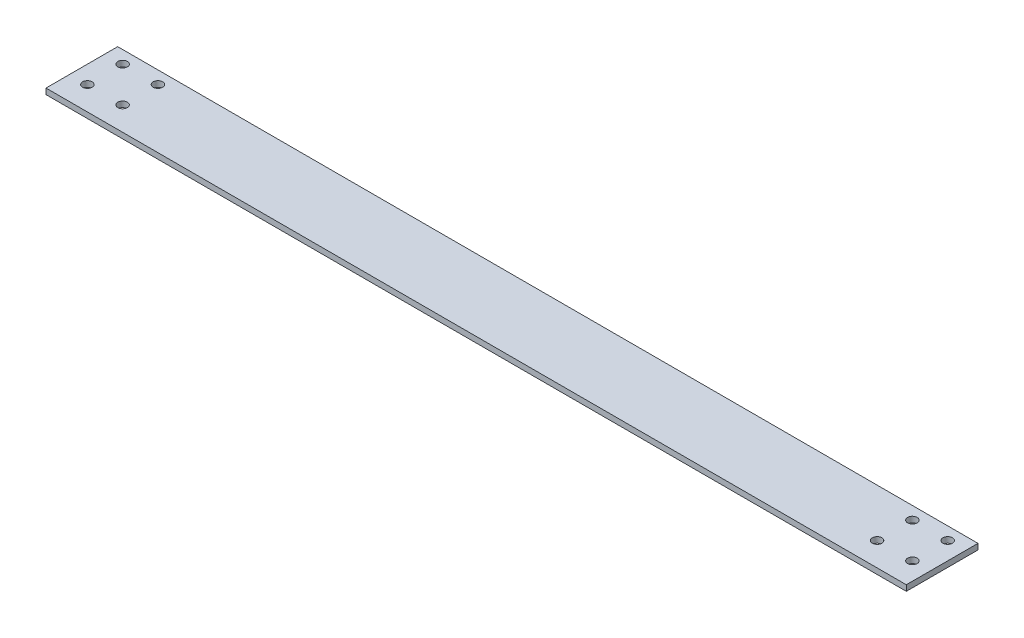
ISO-10303-21;
HEADER;
FILE_DESCRIPTION(('STEP AP214'),'2;1');
FILE_NAME('part.step','',(''),(''),'','','');
FILE_SCHEMA(('AUTOMOTIVE_DESIGN { 1 0 10303 214 1 1 1 1 }'));
ENDSEC;
DATA;
#1=APPLICATION_CONTEXT('core data for automotive mechanical design processes');
#2=APPLICATION_PROTOCOL_DEFINITION('international standard','automotive_design',2000,#1);
#3=PRODUCT_CONTEXT('',#1,'mechanical');
#4=PRODUCT('Part','Part','',(#3));
#5=PRODUCT_RELATED_PRODUCT_CATEGORY('part','',(#4));
#6=PRODUCT_DEFINITION_FORMATION('','',#4);
#7=PRODUCT_DEFINITION_CONTEXT('part definition',#1,'design');
#8=PRODUCT_DEFINITION('design','',#6,#7);
#9=PRODUCT_DEFINITION_SHAPE('','',#8);
#10=(LENGTH_UNIT() NAMED_UNIT(*) SI_UNIT(.MILLI.,.METRE.));
#11=(NAMED_UNIT(*) PLANE_ANGLE_UNIT() SI_UNIT($,.RADIAN.));
#12=(NAMED_UNIT(*) SI_UNIT($,.STERADIAN.) SOLID_ANGLE_UNIT());
#13=UNCERTAINTY_MEASURE_WITH_UNIT(LENGTH_MEASURE(1.E-05),#10,'distance_accuracy_value','');
#14=(GEOMETRIC_REPRESENTATION_CONTEXT(3) GLOBAL_UNCERTAINTY_ASSIGNED_CONTEXT((#13)) GLOBAL_UNIT_ASSIGNED_CONTEXT((#10,
#11,#12)) REPRESENTATION_CONTEXT('',''));
#15=CARTESIAN_POINT('',(0.,0.,0.));
#16=DIRECTION('',(0.,0.,1.));
#17=DIRECTION('',(1.,0.,0.));
#18=AXIS2_PLACEMENT_3D('',#15,#16,#17);
#19=CARTESIAN_POINT('',(0.,4.064,0.));
#20=DIRECTION('',(0.,1.,0.));
#21=DIRECTION('',(0.,0.,1.));
#22=AXIS2_PLACEMENT_3D('',#19,#20,#21);
#23=PLANE('',#22);
#24=CARTESIAN_POINT('',(12.5000000000001,4.064,-41.8000000000001));
#25=DIRECTION('',(0.,-1.,0.));
#26=DIRECTION('',(0.,0.,-1.));
#27=AXIS2_PLACEMENT_3D('',#24,#25,#26);
#28=CIRCLE('',#27,3.3782);
#29=CARTESIAN_POINT('',(12.5000000000001,4.064,-45.1782000000001));
#30=VERTEX_POINT('',#29);
#31=EDGE_CURVE('E151',#30,#30,#28,.T.);
#32=ORIENTED_EDGE('',*,*,#31,.T.);
#33=EDGE_LOOP('',(#32));
#34=FACE_BOUND('',#33,.T.);
#35=CARTESIAN_POINT('',(37.5000000000001,4.064,-41.8000000000001));
#36=DIRECTION('',(0.,-1.,0.));
#37=DIRECTION('',(0.,0.,-1.));
#38=AXIS2_PLACEMENT_3D('',#35,#36,#37);
#39=CIRCLE('',#38,3.3782);
#40=CARTESIAN_POINT('',(37.5000000000001,4.064,-45.1782000000001));
#41=VERTEX_POINT('',#40);
#42=EDGE_CURVE('E145',#41,#41,#39,.T.);
#43=ORIENTED_EDGE('',*,*,#42,.T.);
#44=EDGE_LOOP('',(#43));
#45=FACE_BOUND('',#44,.T.);
#46=CARTESIAN_POINT('',(37.5000000000001,4.064,-16.8000000000001));
#47=DIRECTION('',(0.,-1.,0.));
#48=DIRECTION('',(0.,0.,-1.));
#49=AXIS2_PLACEMENT_3D('',#46,#47,#48);
#50=CIRCLE('',#49,3.3782);
#51=CARTESIAN_POINT('',(37.5000000000001,4.064,-20.1782000000001));
#52=VERTEX_POINT('',#51);
#53=EDGE_CURVE('E139',#52,#52,#50,.T.);
#54=ORIENTED_EDGE('',*,*,#53,.T.);
#55=EDGE_LOOP('',(#54));
#56=FACE_BOUND('',#55,.T.);
#57=CARTESIAN_POINT('',(12.5000000000001,4.064,-16.8000000000001));
#58=DIRECTION('',(0.,-1.,0.));
#59=DIRECTION('',(0.,0.,-1.));
#60=AXIS2_PLACEMENT_3D('',#57,#58,#59);
#61=CIRCLE('',#60,3.3782);
#62=CARTESIAN_POINT('',(12.5000000000001,4.064,-20.1782000000001));
#63=VERTEX_POINT('',#62);
#64=EDGE_CURVE('E133',#63,#63,#61,.T.);
#65=ORIENTED_EDGE('',*,*,#64,.T.);
#66=EDGE_LOOP('',(#65));
#67=FACE_BOUND('',#66,.T.);
#68=CARTESIAN_POINT('',(572.1,4.064,-41.7999999999995));
#69=DIRECTION('',(0.,-1.,0.));
#70=DIRECTION('',(0.,0.,-1.));
#71=AXIS2_PLACEMENT_3D('',#68,#69,#70);
#72=CIRCLE('',#71,3.3782);
#73=CARTESIAN_POINT('',(572.1,4.064,-45.1781999999995));
#74=VERTEX_POINT('',#73);
#75=EDGE_CURVE('E127',#74,#74,#72,.T.);
#76=ORIENTED_EDGE('',*,*,#75,.T.);
#77=EDGE_LOOP('',(#76));
#78=FACE_BOUND('',#77,.T.);
#79=CARTESIAN_POINT('',(597.1,4.064,-41.7999999999995));
#80=DIRECTION('',(0.,-1.,0.));
#81=DIRECTION('',(0.,0.,-1.));
#82=AXIS2_PLACEMENT_3D('',#79,#80,#81);
#83=CIRCLE('',#82,3.3782);
#84=CARTESIAN_POINT('',(597.1,4.064,-45.1781999999995));
#85=VERTEX_POINT('',#84);
#86=EDGE_CURVE('E121',#85,#85,#83,.T.);
#87=ORIENTED_EDGE('',*,*,#86,.T.);
#88=EDGE_LOOP('',(#87));
#89=FACE_BOUND('',#88,.T.);
#90=CARTESIAN_POINT('',(597.1,4.064,-16.7999999999995));
#91=DIRECTION('',(0.,-1.,0.));
#92=DIRECTION('',(0.,0.,-1.));
#93=AXIS2_PLACEMENT_3D('',#90,#91,#92);
#94=CIRCLE('',#93,3.3782);
#95=CARTESIAN_POINT('',(597.1,4.064,-20.1781999999995));
#96=VERTEX_POINT('',#95);
#97=EDGE_CURVE('E115',#96,#96,#94,.T.);
#98=ORIENTED_EDGE('',*,*,#97,.T.);
#99=EDGE_LOOP('',(#98));
#100=FACE_BOUND('',#99,.T.);
#101=DIRECTION('',(0.,0.,1.));
#102=VECTOR('',#101,1.);
#103=CARTESIAN_POINT('',(609.6,4.064,0.));
#104=LINE('',#103,#102);
#105=CARTESIAN_POINT('',(609.6,4.064,-50.8000000000001));
#106=VERTEX_POINT('',#105);
#107=CARTESIAN_POINT('',(609.6,4.064,-1.11998084417753E-13));
#108=VERTEX_POINT('',#107);
#109=EDGE_CURVE('E92',#106,#108,#104,.T.);
#110=ORIENTED_EDGE('',*,*,#109,.F.);
#111=DIRECTION('',(1.,0.,0.));
#112=VECTOR('',#111,1.);
#113=CARTESIAN_POINT('',(0.,4.064,-50.8000000000001));
#114=LINE('',#113,#112);
#115=CARTESIAN_POINT('',(0.,4.064,-50.8000000000001));
#116=VERTEX_POINT('',#115);
#117=EDGE_CURVE('E83',#116,#106,#114,.T.);
#118=ORIENTED_EDGE('',*,*,#117,.F.);
#119=DIRECTION('',(0.,0.,-1.));
#120=VECTOR('',#119,1.);
#121=CARTESIAN_POINT('',(0.,4.064,0.));
#122=LINE('',#121,#120);
#123=CARTESIAN_POINT('',(0.,4.064,0.));
#124=VERTEX_POINT('',#123);
#125=EDGE_CURVE('E91',#124,#116,#122,.T.);
#126=ORIENTED_EDGE('',*,*,#125,.F.);
#127=DIRECTION('',(1.,0.,0.));
#128=VECTOR('',#127,1.);
#129=CARTESIAN_POINT('',(0.,4.064,0.));
#130=LINE('',#129,#128);
#131=EDGE_CURVE('E52',#124,#108,#130,.T.);
#132=ORIENTED_EDGE('',*,*,#131,.T.);
#133=EDGE_LOOP('',(#110,#118,#126,#132));
#134=FACE_BOUND('',#133,.T.);
#135=CARTESIAN_POINT('',(572.1,4.064,-16.7999999999995));
#136=DIRECTION('',(0.,-1.,0.));
#137=DIRECTION('',(0.,0.,-1.));
#138=AXIS2_PLACEMENT_3D('',#135,#136,#137);
#139=CIRCLE('',#138,3.3782);
#140=CARTESIAN_POINT('',(572.1,4.064,-20.1781999999995));
#141=VERTEX_POINT('',#140);
#142=EDGE_CURVE('E102',#141,#141,#139,.T.);
#143=ORIENTED_EDGE('',*,*,#142,.T.);
#144=EDGE_LOOP('',(#143));
#145=FACE_BOUND('',#144,.T.);
#146=ADVANCED_FACE('F35',(#34,#45,#56,#67,#78,#89,#100,#134,#145),#23,.T.);
#147=CARTESIAN_POINT('',(609.6,4.064,0.));
#148=DIRECTION('',(1.,0.,0.));
#149=DIRECTION('',(0.,0.,-1.));
#150=AXIS2_PLACEMENT_3D('',#147,#148,#149);
#151=PLANE('',#150);
#152=DIRECTION('',(0.,0.,1.));
#153=VECTOR('',#152,1.);
#154=CARTESIAN_POINT('',(609.6,0.,0.));
#155=LINE('',#154,#153);
#156=CARTESIAN_POINT('',(609.6,0.,-50.8000000000001));
#157=VERTEX_POINT('',#156);
#158=CARTESIAN_POINT('',(609.6,0.,-1.11998084417753E-13));
#159=VERTEX_POINT('',#158);
#160=EDGE_CURVE('E99',#157,#159,#155,.T.);
#161=ORIENTED_EDGE('',*,*,#160,.F.);
#162=DIRECTION('',(0.,-1.,0.));
#163=VECTOR('',#162,1.);
#164=CARTESIAN_POINT('',(609.6,4.064,-50.8000000000001));
#165=LINE('',#164,#163);
#166=EDGE_CURVE('E11',#106,#157,#165,.T.);
#167=ORIENTED_EDGE('',*,*,#166,.F.);
#168=ORIENTED_EDGE('',*,*,#109,.T.);
#169=DIRECTION('',(0.,-1.,0.));
#170=VECTOR('',#169,1.);
#171=CARTESIAN_POINT('',(609.6,4.064,-1.11998084417753E-13));
#172=LINE('',#171,#170);
#173=EDGE_CURVE('E74',#108,#159,#172,.T.);
#174=ORIENTED_EDGE('',*,*,#173,.T.);
#175=EDGE_LOOP('',(#161,#167,#168,#174));
#176=FACE_BOUND('',#175,.T.);
#177=ADVANCED_FACE('F37',(#176),#151,.T.);
#178=CARTESIAN_POINT('',(0.,4.064,-50.8000000000001));
#179=DIRECTION('',(0.,0.,-1.));
#180=DIRECTION('',(-1.,0.,0.));
#181=AXIS2_PLACEMENT_3D('',#178,#179,#180);
#182=PLANE('',#181);
#183=DIRECTION('',(1.,0.,0.));
#184=VECTOR('',#183,1.);
#185=CARTESIAN_POINT('',(0.,0.,-50.8000000000001));
#186=LINE('',#185,#184);
#187=CARTESIAN_POINT('',(0.,0.,-50.8000000000001));
#188=VERTEX_POINT('',#187);
#189=EDGE_CURVE('E85',#188,#157,#186,.T.);
#190=ORIENTED_EDGE('',*,*,#189,.F.);
#191=DIRECTION('',(0.,-1.,0.));
#192=VECTOR('',#191,1.);
#193=CARTESIAN_POINT('',(0.,4.064,-50.8000000000001));
#194=LINE('',#193,#192);
#195=EDGE_CURVE('E44',#116,#188,#194,.T.);
#196=ORIENTED_EDGE('',*,*,#195,.F.);
#197=ORIENTED_EDGE('',*,*,#117,.T.);
#198=ORIENTED_EDGE('',*,*,#166,.T.);
#199=EDGE_LOOP('',(#190,#196,#197,#198));
#200=FACE_BOUND('',#199,.T.);
#201=ADVANCED_FACE('F82',(#200),#182,.T.);
#202=CARTESIAN_POINT('',(0.,4.064,0.));
#203=DIRECTION('',(-1.,0.,0.));
#204=DIRECTION('',(0.,0.,1.));
#205=AXIS2_PLACEMENT_3D('',#202,#203,#204);
#206=PLANE('',#205);
#207=DIRECTION('',(0.,0.,-1.));
#208=VECTOR('',#207,1.);
#209=CARTESIAN_POINT('',(0.,0.,0.));
#210=LINE('',#209,#208);
#211=CARTESIAN_POINT('',(0.,0.,0.));
#212=VERTEX_POINT('',#211);
#213=EDGE_CURVE('E104',#212,#188,#210,.T.);
#214=ORIENTED_EDGE('',*,*,#213,.F.);
#215=DIRECTION('',(0.,-1.,0.));
#216=VECTOR('',#215,1.);
#217=CARTESIAN_POINT('',(0.,4.064,0.));
#218=LINE('',#217,#216);
#219=EDGE_CURVE('E67',#124,#212,#218,.T.);
#220=ORIENTED_EDGE('',*,*,#219,.F.);
#221=ORIENTED_EDGE('',*,*,#125,.T.);
#222=ORIENTED_EDGE('',*,*,#195,.T.);
#223=EDGE_LOOP('',(#214,#220,#221,#222));
#224=FACE_BOUND('',#223,.T.);
#225=ADVANCED_FACE('F94',(#224),#206,.T.);
#226=CARTESIAN_POINT('',(0.,4.064,0.));
#227=DIRECTION('',(0.,0.,-1.));
#228=DIRECTION('',(-1.,0.,0.));
#229=AXIS2_PLACEMENT_3D('',#226,#227,#228);
#230=PLANE('',#229);
#231=DIRECTION('',(1.,0.,0.));
#232=VECTOR('',#231,1.);
#233=CARTESIAN_POINT('',(0.,0.,0.));
#234=LINE('',#233,#232);
#235=EDGE_CURVE('E106',#212,#159,#234,.T.);
#236=ORIENTED_EDGE('',*,*,#235,.T.);
#237=ORIENTED_EDGE('',*,*,#173,.F.);
#238=ORIENTED_EDGE('',*,*,#131,.F.);
#239=ORIENTED_EDGE('',*,*,#219,.T.);
#240=EDGE_LOOP('',(#236,#237,#238,#239));
#241=FACE_BOUND('',#240,.T.);
#242=ADVANCED_FACE('F164',(#241),#230,.F.);
#243=CARTESIAN_POINT('',(0.,0.,0.));
#244=DIRECTION('',(0.,1.,0.));
#245=DIRECTION('',(0.,0.,1.));
#246=AXIS2_PLACEMENT_3D('',#243,#244,#245);
#247=PLANE('',#246);
#248=CARTESIAN_POINT('',(12.5000000000001,0.,-41.8000000000001));
#249=DIRECTION('',(0.,-1.,0.));
#250=DIRECTION('',(0.,0.,-1.));
#251=AXIS2_PLACEMENT_3D('',#248,#249,#250);
#252=CIRCLE('',#251,3.37819999999999);
#253=CARTESIAN_POINT('',(12.5000000000001,0.,-45.1782000000001));
#254=VERTEX_POINT('',#253);
#255=EDGE_CURVE('E154',#254,#254,#252,.T.);
#256=ORIENTED_EDGE('',*,*,#255,.F.);
#257=EDGE_LOOP('',(#256));
#258=FACE_BOUND('',#257,.T.);
#259=CARTESIAN_POINT('',(37.5000000000001,0.,-41.8000000000001));
#260=DIRECTION('',(0.,-1.,0.));
#261=DIRECTION('',(0.,0.,-1.));
#262=AXIS2_PLACEMENT_3D('',#259,#260,#261);
#263=CIRCLE('',#262,3.37819999999998);
#264=CARTESIAN_POINT('',(37.5000000000001,0.,-45.1782000000001));
#265=VERTEX_POINT('',#264);
#266=EDGE_CURVE('E148',#265,#265,#263,.T.);
#267=ORIENTED_EDGE('',*,*,#266,.F.);
#268=EDGE_LOOP('',(#267));
#269=FACE_BOUND('',#268,.T.);
#270=CARTESIAN_POINT('',(37.5000000000001,0.,-16.8000000000001));
#271=DIRECTION('',(0.,-1.,0.));
#272=DIRECTION('',(0.,0.,-1.));
#273=AXIS2_PLACEMENT_3D('',#270,#271,#272);
#274=CIRCLE('',#273,3.37819999999998);
#275=CARTESIAN_POINT('',(37.5000000000001,0.,-20.1782000000001));
#276=VERTEX_POINT('',#275);
#277=EDGE_CURVE('E142',#276,#276,#274,.T.);
#278=ORIENTED_EDGE('',*,*,#277,.F.);
#279=EDGE_LOOP('',(#278));
#280=FACE_BOUND('',#279,.T.);
#281=CARTESIAN_POINT('',(12.5000000000001,0.,-16.8000000000001));
#282=DIRECTION('',(0.,-1.,0.));
#283=DIRECTION('',(0.,0.,-1.));
#284=AXIS2_PLACEMENT_3D('',#281,#282,#283);
#285=CIRCLE('',#284,3.37819999999999);
#286=CARTESIAN_POINT('',(12.5000000000001,0.,-20.1782000000001));
#287=VERTEX_POINT('',#286);
#288=EDGE_CURVE('E136',#287,#287,#285,.T.);
#289=ORIENTED_EDGE('',*,*,#288,.F.);
#290=EDGE_LOOP('',(#289));
#291=FACE_BOUND('',#290,.T.);
#292=CARTESIAN_POINT('',(572.1,0.,-41.7999999999995));
#293=DIRECTION('',(0.,-1.,0.));
#294=DIRECTION('',(0.,0.,-1.));
#295=AXIS2_PLACEMENT_3D('',#292,#293,#294);
#296=CIRCLE('',#295,3.3782);
#297=CARTESIAN_POINT('',(572.1,0.,-45.1781999999995));
#298=VERTEX_POINT('',#297);
#299=EDGE_CURVE('E130',#298,#298,#296,.T.);
#300=ORIENTED_EDGE('',*,*,#299,.F.);
#301=EDGE_LOOP('',(#300));
#302=FACE_BOUND('',#301,.T.);
#303=CARTESIAN_POINT('',(597.1,0.,-41.7999999999995));
#304=DIRECTION('',(0.,-1.,0.));
#305=DIRECTION('',(0.,0.,-1.));
#306=AXIS2_PLACEMENT_3D('',#303,#304,#305);
#307=CIRCLE('',#306,3.3782);
#308=CARTESIAN_POINT('',(597.1,0.,-45.1781999999995));
#309=VERTEX_POINT('',#308);
#310=EDGE_CURVE('E124',#309,#309,#307,.T.);
#311=ORIENTED_EDGE('',*,*,#310,.F.);
#312=EDGE_LOOP('',(#311));
#313=FACE_BOUND('',#312,.T.);
#314=CARTESIAN_POINT('',(597.1,0.,-16.7999999999995));
#315=DIRECTION('',(0.,-1.,0.));
#316=DIRECTION('',(0.,0.,-1.));
#317=AXIS2_PLACEMENT_3D('',#314,#315,#316);
#318=CIRCLE('',#317,3.3782);
#319=CARTESIAN_POINT('',(597.1,0.,-20.1781999999995));
#320=VERTEX_POINT('',#319);
#321=EDGE_CURVE('E118',#320,#320,#318,.T.);
#322=ORIENTED_EDGE('',*,*,#321,.F.);
#323=EDGE_LOOP('',(#322));
#324=FACE_BOUND('',#323,.T.);
#325=CARTESIAN_POINT('',(572.1,0.,-16.7999999999995));
#326=DIRECTION('',(0.,-1.,0.));
#327=DIRECTION('',(0.,0.,-1.));
#328=AXIS2_PLACEMENT_3D('',#325,#326,#327);
#329=CIRCLE('',#328,3.3782);
#330=CARTESIAN_POINT('',(572.1,0.,-20.1781999999995));
#331=VERTEX_POINT('',#330);
#332=EDGE_CURVE('E112',#331,#331,#329,.T.);
#333=ORIENTED_EDGE('',*,*,#332,.F.);
#334=EDGE_LOOP('',(#333));
#335=FACE_BOUND('',#334,.T.);
#336=ORIENTED_EDGE('',*,*,#160,.T.);
#337=ORIENTED_EDGE('',*,*,#235,.F.);
#338=ORIENTED_EDGE('',*,*,#213,.T.);
#339=ORIENTED_EDGE('',*,*,#189,.T.);
#340=EDGE_LOOP('',(#336,#337,#338,#339));
#341=FACE_BOUND('',#340,.T.);
#342=ADVANCED_FACE('F160',(#258,#269,#280,#291,#302,#313,#324,#335,#341),#247,.F.);
#343=CARTESIAN_POINT('',(572.1,0.,-16.7999999999995));
#344=DIRECTION('',(0.,-1.,0.));
#345=DIRECTION('',(0.,0.,-1.));
#346=AXIS2_PLACEMENT_3D('',#343,#344,#345);
#347=CYLINDRICAL_SURFACE('',#346,3.3782);
#348=ORIENTED_EDGE('',*,*,#142,.F.);
#349=EDGE_LOOP('',(#348));
#350=FACE_BOUND('',#349,.T.);
#351=ORIENTED_EDGE('',*,*,#332,.T.);
#352=EDGE_LOOP('',(#351));
#353=FACE_BOUND('',#352,.T.);
#354=ADVANCED_FACE('F163',(#350,#353),#347,.F.);
#355=CARTESIAN_POINT('',(597.1,0.,-16.7999999999995));
#356=DIRECTION('',(0.,-1.,0.));
#357=DIRECTION('',(0.,0.,-1.));
#358=AXIS2_PLACEMENT_3D('',#355,#356,#357);
#359=CYLINDRICAL_SURFACE('',#358,3.3782);
#360=ORIENTED_EDGE('',*,*,#97,.F.);
#361=EDGE_LOOP('',(#360));
#362=FACE_BOUND('',#361,.T.);
#363=ORIENTED_EDGE('',*,*,#321,.T.);
#364=EDGE_LOOP('',(#363));
#365=FACE_BOUND('',#364,.T.);
#366=ADVANCED_FACE('F214',(#362,#365),#359,.F.);
#367=CARTESIAN_POINT('',(597.1,0.,-41.7999999999995));
#368=DIRECTION('',(0.,-1.,0.));
#369=DIRECTION('',(0.,0.,-1.));
#370=AXIS2_PLACEMENT_3D('',#367,#368,#369);
#371=CYLINDRICAL_SURFACE('',#370,3.3782);
#372=ORIENTED_EDGE('',*,*,#86,.F.);
#373=EDGE_LOOP('',(#372));
#374=FACE_BOUND('',#373,.T.);
#375=ORIENTED_EDGE('',*,*,#310,.T.);
#376=EDGE_LOOP('',(#375));
#377=FACE_BOUND('',#376,.T.);
#378=ADVANCED_FACE('F221',(#374,#377),#371,.F.);
#379=CARTESIAN_POINT('',(572.1,0.,-41.7999999999995));
#380=DIRECTION('',(0.,-1.,0.));
#381=DIRECTION('',(0.,0.,-1.));
#382=AXIS2_PLACEMENT_3D('',#379,#380,#381);
#383=CYLINDRICAL_SURFACE('',#382,3.3782);
#384=ORIENTED_EDGE('',*,*,#75,.F.);
#385=EDGE_LOOP('',(#384));
#386=FACE_BOUND('',#385,.T.);
#387=ORIENTED_EDGE('',*,*,#299,.T.);
#388=EDGE_LOOP('',(#387));
#389=FACE_BOUND('',#388,.T.);
#390=ADVANCED_FACE('F228',(#386,#389),#383,.F.);
#391=CARTESIAN_POINT('',(12.5000000000001,0.,-16.8000000000001));
#392=DIRECTION('',(0.,-1.,0.));
#393=DIRECTION('',(0.,0.,-1.));
#394=AXIS2_PLACEMENT_3D('',#391,#392,#393);
#395=CYLINDRICAL_SURFACE('',#394,3.37819999999999);
#396=ORIENTED_EDGE('',*,*,#64,.F.);
#397=EDGE_LOOP('',(#396));
#398=FACE_BOUND('',#397,.T.);
#399=ORIENTED_EDGE('',*,*,#288,.T.);
#400=EDGE_LOOP('',(#399));
#401=FACE_BOUND('',#400,.T.);
#402=ADVANCED_FACE('F236',(#398,#401),#395,.F.);
#403=CARTESIAN_POINT('',(37.5000000000001,0.,-16.8000000000001));
#404=DIRECTION('',(0.,-1.,0.));
#405=DIRECTION('',(0.,0.,-1.));
#406=AXIS2_PLACEMENT_3D('',#403,#404,#405);
#407=CYLINDRICAL_SURFACE('',#406,3.37819999999999);
#408=ORIENTED_EDGE('',*,*,#53,.F.);
#409=EDGE_LOOP('',(#408));
#410=FACE_BOUND('',#409,.T.);
#411=ORIENTED_EDGE('',*,*,#277,.T.);
#412=EDGE_LOOP('',(#411));
#413=FACE_BOUND('',#412,.T.);
#414=ADVANCED_FACE('F244',(#410,#413),#407,.F.);
#415=CARTESIAN_POINT('',(37.5000000000001,0.,-41.8000000000001));
#416=DIRECTION('',(0.,-1.,0.));
#417=DIRECTION('',(0.,0.,-1.));
#418=AXIS2_PLACEMENT_3D('',#415,#416,#417);
#419=CYLINDRICAL_SURFACE('',#418,3.37819999999999);
#420=ORIENTED_EDGE('',*,*,#42,.F.);
#421=EDGE_LOOP('',(#420));
#422=FACE_BOUND('',#421,.T.);
#423=ORIENTED_EDGE('',*,*,#266,.T.);
#424=EDGE_LOOP('',(#423));
#425=FACE_BOUND('',#424,.T.);
#426=ADVANCED_FACE('F252',(#422,#425),#419,.F.);
#427=CARTESIAN_POINT('',(12.5000000000001,0.,-41.8000000000001));
#428=DIRECTION('',(0.,-1.,0.));
#429=DIRECTION('',(0.,0.,-1.));
#430=AXIS2_PLACEMENT_3D('',#427,#428,#429);
#431=CYLINDRICAL_SURFACE('',#430,3.37819999999999);
#432=ORIENTED_EDGE('',*,*,#31,.F.);
#433=EDGE_LOOP('',(#432));
#434=FACE_BOUND('',#433,.T.);
#435=ORIENTED_EDGE('',*,*,#255,.T.);
#436=EDGE_LOOP('',(#435));
#437=FACE_BOUND('',#436,.T.);
#438=ADVANCED_FACE('F158',(#434,#437),#431,.F.);
#439=CLOSED_SHELL('',(#146,#177,#201,#225,#242,#342,#354,#366,#378,#390,#402,#414,#426,#438));
#440=MANIFOLD_SOLID_BREP('B2',#439);
#441=ADVANCED_BREP_SHAPE_REPRESENTATION('',(#18,#440),#14);
#442=SHAPE_DEFINITION_REPRESENTATION(#9,#441);
ENDSEC;
END-ISO-10303-21;
